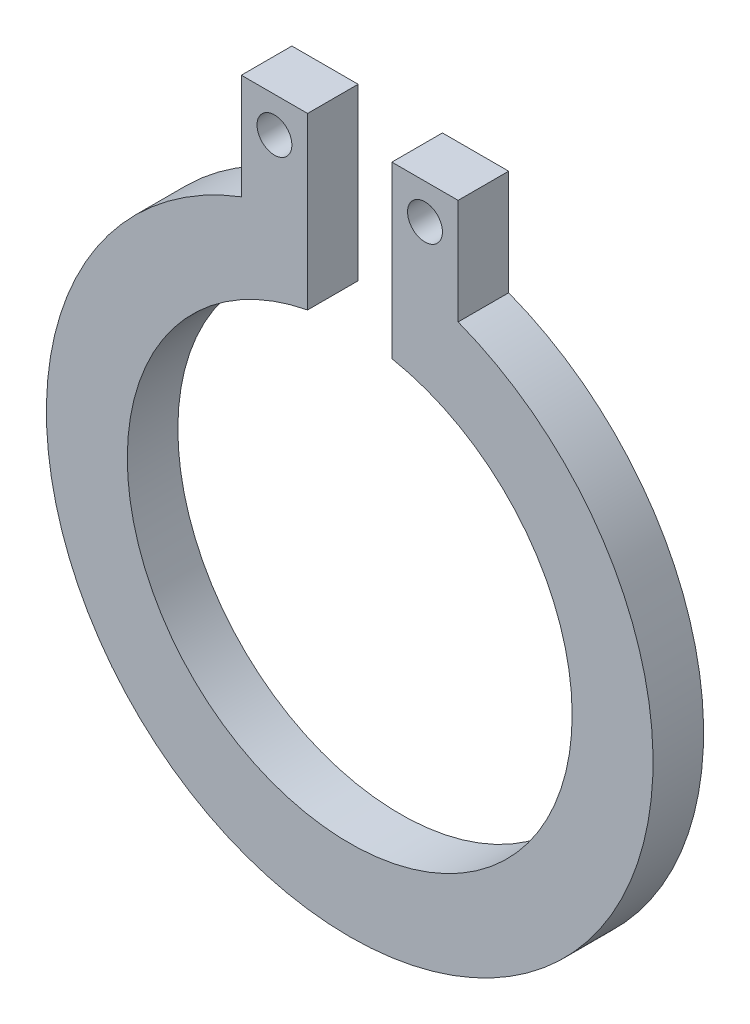
ISO-10303-21;
HEADER;
FILE_DESCRIPTION(('STEP AP214'),'2;1');
FILE_NAME('part.step','',(''),(''),'','','');
FILE_SCHEMA(('AUTOMOTIVE_DESIGN { 1 0 10303 214 1 1 1 1 }'));
ENDSEC;
DATA;
#1=APPLICATION_CONTEXT('core data for automotive mechanical design processes');
#2=APPLICATION_PROTOCOL_DEFINITION('international standard','automotive_design',2000,#1);
#3=PRODUCT_CONTEXT('',#1,'mechanical');
#4=PRODUCT('Part','Part','',(#3));
#5=PRODUCT_RELATED_PRODUCT_CATEGORY('part','',(#4));
#6=PRODUCT_DEFINITION_FORMATION('','',#4);
#7=PRODUCT_DEFINITION_CONTEXT('part definition',#1,'design');
#8=PRODUCT_DEFINITION('design','',#6,#7);
#9=PRODUCT_DEFINITION_SHAPE('','',#8);
#10=(LENGTH_UNIT() NAMED_UNIT(*) SI_UNIT(.MILLI.,.METRE.));
#11=(NAMED_UNIT(*) PLANE_ANGLE_UNIT() SI_UNIT($,.RADIAN.));
#12=(NAMED_UNIT(*) SI_UNIT($,.STERADIAN.) SOLID_ANGLE_UNIT());
#13=UNCERTAINTY_MEASURE_WITH_UNIT(LENGTH_MEASURE(1.E-05),#10,'distance_accuracy_value','');
#14=(GEOMETRIC_REPRESENTATION_CONTEXT(3) GLOBAL_UNCERTAINTY_ASSIGNED_CONTEXT((#13)) GLOBAL_UNIT_ASSIGNED_CONTEXT((#10,
#11,#12)) REPRESENTATION_CONTEXT('',''));
#15=CARTESIAN_POINT('',(0.,0.,0.));
#16=DIRECTION('',(0.,0.,1.));
#17=DIRECTION('',(1.,0.,0.));
#18=AXIS2_PLACEMENT_3D('',#15,#16,#17);
#19=CARTESIAN_POINT('',(0.,0.,0.5));
#20=DIRECTION('',(0.,0.,1.));
#21=DIRECTION('',(1.,0.,0.));
#22=AXIS2_PLACEMENT_3D('',#19,#20,#21);
#23=PLANE('',#22);
#24=CARTESIAN_POINT('',(0.744424879695825,3.49516054122899,0.5));
#25=DIRECTION('',(0.,0.,1.));
#26=DIRECTION('',(1.,0.,0.));
#27=AXIS2_PLACEMENT_3D('',#24,#25,#26);
#28=CIRCLE('',#27,0.172416740633927);
#29=CARTESIAN_POINT('',(0.916841620329752,3.49516054122899,0.5));
#30=VERTEX_POINT('',#29);
#31=EDGE_CURVE('E134',#30,#30,#28,.T.);
#32=ORIENTED_EDGE('',*,*,#31,.F.);
#33=EDGE_LOOP('',(#32));
#34=FACE_BOUND('',#33,.T.);
#35=CARTESIAN_POINT('',(0.,0.,0.5));
#36=DIRECTION('',(0.,0.,1.));
#37=DIRECTION('',(1.,0.,0.));
#38=AXIS2_PLACEMENT_3D('',#35,#36,#37);
#39=CIRCLE('',#38,3.);
#40=CARTESIAN_POINT('',(-1.07201668690029,2.80192437853118,0.5));
#41=VERTEX_POINT('',#40);
#42=CARTESIAN_POINT('',(1.07201668690029,2.80192437853118,0.5));
#43=VERTEX_POINT('',#42);
#44=EDGE_CURVE('E145',#41,#43,#39,.T.);
#45=ORIENTED_EDGE('',*,*,#44,.T.);
#46=DIRECTION('',(0.,1.,0.));
#47=VECTOR('',#46,1.);
#48=CARTESIAN_POINT('',(1.07201668690029,2.80192437853118,0.5));
#49=LINE('',#48,#47);
#50=CARTESIAN_POINT('',(1.07201668690029,3.84367980887387,0.5));
#51=VERTEX_POINT('',#50);
#52=EDGE_CURVE('E93',#43,#51,#49,.T.);
#53=ORIENTED_EDGE('',*,*,#52,.T.);
#54=DIRECTION('',(-1.,0.,0.));
#55=VECTOR('',#54,1.);
#56=CARTESIAN_POINT('',(1.07201668690029,3.84367980887387,0.5));
#57=LINE('',#56,#55);
#58=CARTESIAN_POINT('',(0.416833072491364,3.84367980887387,0.5));
#59=VERTEX_POINT('',#58);
#60=EDGE_CURVE('E160',#51,#59,#57,.T.);
#61=ORIENTED_EDGE('',*,*,#60,.T.);
#62=DIRECTION('',(0.,-1.,0.));
#63=VECTOR('',#62,1.);
#64=CARTESIAN_POINT('',(0.416833072491364,3.84367980887387,0.5));
#65=LINE('',#64,#63);
#66=CARTESIAN_POINT('',(0.416833072491364,2.16015050162654,0.5));
#67=VERTEX_POINT('',#66);
#68=EDGE_CURVE('E173',#59,#67,#65,.T.);
#69=ORIENTED_EDGE('',*,*,#68,.T.);
#70=CARTESIAN_POINT('',(0.,0.,0.5));
#71=DIRECTION('',(0.,0.,-1.));
#72=DIRECTION('',(1.,0.,0.));
#73=AXIS2_PLACEMENT_3D('',#70,#71,#72);
#74=CIRCLE('',#73,2.2);
#75=CARTESIAN_POINT('',(-0.416833072491364,2.16015050162654,0.5));
#76=VERTEX_POINT('',#75);
#77=EDGE_CURVE('E112',#67,#76,#74,.T.);
#78=ORIENTED_EDGE('',*,*,#77,.T.);
#79=DIRECTION('',(0.,1.,0.));
#80=VECTOR('',#79,1.);
#81=CARTESIAN_POINT('',(-0.416833072491364,3.84367980887387,0.5));
#82=LINE('',#81,#80);
#83=CARTESIAN_POINT('',(-0.416833072491364,3.84367980887387,0.5));
#84=VERTEX_POINT('',#83);
#85=EDGE_CURVE('E106',#76,#84,#82,.T.);
#86=ORIENTED_EDGE('',*,*,#85,.T.);
#87=DIRECTION('',(-1.,0.,0.));
#88=VECTOR('',#87,1.);
#89=CARTESIAN_POINT('',(-1.07201668690029,3.84367980887387,0.5));
#90=LINE('',#89,#88);
#91=CARTESIAN_POINT('',(-1.07201668690029,3.84367980887387,0.5));
#92=VERTEX_POINT('',#91);
#93=EDGE_CURVE('E110',#84,#92,#90,.T.);
#94=ORIENTED_EDGE('',*,*,#93,.T.);
#95=DIRECTION('',(0.,-1.,0.));
#96=VECTOR('',#95,1.);
#97=CARTESIAN_POINT('',(-1.07201668690029,2.80192437853118,0.5));
#98=LINE('',#97,#96);
#99=EDGE_CURVE('E50',#92,#41,#98,.T.);
#100=ORIENTED_EDGE('',*,*,#99,.T.);
#101=EDGE_LOOP('',(#45,#53,#61,#69,#78,#86,#94,#100));
#102=FACE_BOUND('',#101,.T.);
#103=CARTESIAN_POINT('',(-0.744424879695825,3.49516054122899,0.5));
#104=DIRECTION('',(0.,0.,1.));
#105=DIRECTION('',(-1.,0.,0.));
#106=AXIS2_PLACEMENT_3D('',#103,#104,#105);
#107=CIRCLE('',#106,0.172416740633927);
#108=CARTESIAN_POINT('',(-0.916841620329752,3.49516054122899,0.5));
#109=VERTEX_POINT('',#108);
#110=EDGE_CURVE('E182',#109,#109,#107,.T.);
#111=ORIENTED_EDGE('',*,*,#110,.F.);
#112=EDGE_LOOP('',(#111));
#113=FACE_BOUND('',#112,.T.);
#114=ADVANCED_FACE('F33',(#34,#102,#113),#23,.T.);
#115=CARTESIAN_POINT('',(0.,0.,0.));
#116=DIRECTION('',(0.,0.,1.));
#117=DIRECTION('',(1.,0.,0.));
#118=AXIS2_PLACEMENT_3D('',#115,#116,#117);
#119=PLANE('',#118);
#120=CARTESIAN_POINT('',(0.,0.,0.));
#121=DIRECTION('',(0.,0.,1.));
#122=DIRECTION('',(1.,0.,0.));
#123=AXIS2_PLACEMENT_3D('',#120,#121,#122);
#124=CIRCLE('',#123,3.);
#125=CARTESIAN_POINT('',(-1.07201668690029,2.80192437853118,0.));
#126=VERTEX_POINT('',#125);
#127=CARTESIAN_POINT('',(1.07201668690029,2.80192437853118,0.));
#128=VERTEX_POINT('',#127);
#129=EDGE_CURVE('E130',#126,#128,#124,.T.);
#130=ORIENTED_EDGE('',*,*,#129,.F.);
#131=DIRECTION('',(0.,-1.,0.));
#132=VECTOR('',#131,1.);
#133=CARTESIAN_POINT('',(-1.07201668690029,2.80192437853118,0.));
#134=LINE('',#133,#132);
#135=CARTESIAN_POINT('',(-1.07201668690029,3.84367980887387,0.));
#136=VERTEX_POINT('',#135);
#137=EDGE_CURVE('E85',#136,#126,#134,.T.);
#138=ORIENTED_EDGE('',*,*,#137,.F.);
#139=DIRECTION('',(-1.,0.,0.));
#140=VECTOR('',#139,1.);
#141=CARTESIAN_POINT('',(-1.07201668690029,3.84367980887387,0.));
#142=LINE('',#141,#140);
#143=CARTESIAN_POINT('',(-0.416833072491364,3.84367980887387,0.));
#144=VERTEX_POINT('',#143);
#145=EDGE_CURVE('E79',#144,#136,#142,.T.);
#146=ORIENTED_EDGE('',*,*,#145,.F.);
#147=DIRECTION('',(0.,1.,0.));
#148=VECTOR('',#147,1.);
#149=CARTESIAN_POINT('',(-0.416833072491364,3.84367980887387,0.));
#150=LINE('',#149,#148);
#151=CARTESIAN_POINT('',(-0.416833072491364,2.16015050162654,0.));
#152=VERTEX_POINT('',#151);
#153=EDGE_CURVE('E120',#152,#144,#150,.T.);
#154=ORIENTED_EDGE('',*,*,#153,.F.);
#155=CARTESIAN_POINT('',(0.,0.,0.));
#156=DIRECTION('',(0.,0.,-1.));
#157=DIRECTION('',(1.,0.,0.));
#158=AXIS2_PLACEMENT_3D('',#155,#156,#157);
#159=CIRCLE('',#158,2.2);
#160=CARTESIAN_POINT('',(0.416833072491364,2.16015050162654,0.));
#161=VERTEX_POINT('',#160);
#162=EDGE_CURVE('E140',#161,#152,#159,.T.);
#163=ORIENTED_EDGE('',*,*,#162,.F.);
#164=DIRECTION('',(0.,-1.,0.));
#165=VECTOR('',#164,1.);
#166=CARTESIAN_POINT('',(0.416833072491364,3.84367980887387,0.));
#167=LINE('',#166,#165);
#168=CARTESIAN_POINT('',(0.416833072491364,3.84367980887387,0.));
#169=VERTEX_POINT('',#168);
#170=EDGE_CURVE('E138',#169,#161,#167,.T.);
#171=ORIENTED_EDGE('',*,*,#170,.F.);
#172=DIRECTION('',(-1.,0.,0.));
#173=VECTOR('',#172,1.);
#174=CARTESIAN_POINT('',(1.07201668690029,3.84367980887387,0.));
#175=LINE('',#174,#173);
#176=CARTESIAN_POINT('',(1.07201668690029,3.84367980887387,0.));
#177=VERTEX_POINT('',#176);
#178=EDGE_CURVE('E136',#177,#169,#175,.T.);
#179=ORIENTED_EDGE('',*,*,#178,.F.);
#180=DIRECTION('',(0.,1.,0.));
#181=VECTOR('',#180,1.);
#182=CARTESIAN_POINT('',(1.07201668690029,2.80192437853118,0.));
#183=LINE('',#182,#181);
#184=EDGE_CURVE('E133',#128,#177,#183,.T.);
#185=ORIENTED_EDGE('',*,*,#184,.F.);
#186=EDGE_LOOP('',(#130,#138,#146,#154,#163,#171,#179,#185));
#187=FACE_BOUND('',#186,.T.);
#188=CARTESIAN_POINT('',(0.744424879695825,3.49516054122899,0.));
#189=DIRECTION('',(0.,0.,1.));
#190=DIRECTION('',(1.,0.,0.));
#191=AXIS2_PLACEMENT_3D('',#188,#189,#190);
#192=CIRCLE('',#191,0.172416740633927);
#193=CARTESIAN_POINT('',(0.916841620329752,3.49516054122899,0.));
#194=VERTEX_POINT('',#193);
#195=EDGE_CURVE('E179',#194,#194,#192,.T.);
#196=ORIENTED_EDGE('',*,*,#195,.T.);
#197=EDGE_LOOP('',(#196));
#198=FACE_BOUND('',#197,.T.);
#199=CARTESIAN_POINT('',(-0.744424879695825,3.49516054122899,0.));
#200=DIRECTION('',(0.,0.,1.));
#201=DIRECTION('',(-1.,0.,0.));
#202=AXIS2_PLACEMENT_3D('',#199,#200,#201);
#203=CIRCLE('',#202,0.172416740633927);
#204=CARTESIAN_POINT('',(-0.916841620329752,3.49516054122899,0.));
#205=VERTEX_POINT('',#204);
#206=EDGE_CURVE('E185',#205,#205,#203,.T.);
#207=ORIENTED_EDGE('',*,*,#206,.T.);
#208=EDGE_LOOP('',(#207));
#209=FACE_BOUND('',#208,.T.);
#210=ADVANCED_FACE('F164',(#187,#198,#209),#119,.F.);
#211=CARTESIAN_POINT('',(0.,0.,0.5));
#212=DIRECTION('',(0.,0.,-1.));
#213=DIRECTION('',(-1.,0.,0.));
#214=AXIS2_PLACEMENT_3D('',#211,#212,#213);
#215=CYLINDRICAL_SURFACE('',#214,3.);
#216=ORIENTED_EDGE('',*,*,#129,.T.);
#217=DIRECTION('',(0.,0.,-1.));
#218=VECTOR('',#217,1.);
#219=CARTESIAN_POINT('',(1.07201668690029,2.80192437853118,0.5));
#220=LINE('',#219,#218);
#221=EDGE_CURVE('E11',#43,#128,#220,.T.);
#222=ORIENTED_EDGE('',*,*,#221,.F.);
#223=ORIENTED_EDGE('',*,*,#44,.F.);
#224=DIRECTION('',(0.,0.,-1.));
#225=VECTOR('',#224,1.);
#226=CARTESIAN_POINT('',(-1.07201668690029,2.80192437853118,0.5));
#227=LINE('',#226,#225);
#228=EDGE_CURVE('E126',#41,#126,#227,.T.);
#229=ORIENTED_EDGE('',*,*,#228,.T.);
#230=EDGE_LOOP('',(#216,#222,#223,#229));
#231=FACE_BOUND('',#230,.T.);
#232=ADVANCED_FACE('F35',(#231),#215,.T.);
#233=CARTESIAN_POINT('',(1.07201668690029,2.80192437853118,0.5));
#234=DIRECTION('',(-1.,0.,0.));
#235=DIRECTION('',(0.,0.,1.));
#236=AXIS2_PLACEMENT_3D('',#233,#234,#235);
#237=PLANE('',#236);
#238=ORIENTED_EDGE('',*,*,#184,.T.);
#239=DIRECTION('',(0.,0.,-1.));
#240=VECTOR('',#239,1.);
#241=CARTESIAN_POINT('',(1.07201668690029,3.84367980887387,0.5));
#242=LINE('',#241,#240);
#243=EDGE_CURVE('E42',#51,#177,#242,.T.);
#244=ORIENTED_EDGE('',*,*,#243,.F.);
#245=ORIENTED_EDGE('',*,*,#52,.F.);
#246=ORIENTED_EDGE('',*,*,#221,.T.);
#247=EDGE_LOOP('',(#238,#244,#245,#246));
#248=FACE_BOUND('',#247,.T.);
#249=ADVANCED_FACE('F217',(#248),#237,.F.);
#250=CARTESIAN_POINT('',(1.07201668690029,3.84367980887387,0.5));
#251=DIRECTION('',(0.,-1.,0.));
#252=DIRECTION('',(0.,0.,-1.));
#253=AXIS2_PLACEMENT_3D('',#250,#251,#252);
#254=PLANE('',#253);
#255=ORIENTED_EDGE('',*,*,#178,.T.);
#256=DIRECTION('',(0.,0.,-1.));
#257=VECTOR('',#256,1.);
#258=CARTESIAN_POINT('',(0.416833072491364,3.84367980887387,0.5));
#259=LINE('',#258,#257);
#260=EDGE_CURVE('E152',#59,#169,#259,.T.);
#261=ORIENTED_EDGE('',*,*,#260,.F.);
#262=ORIENTED_EDGE('',*,*,#60,.F.);
#263=ORIENTED_EDGE('',*,*,#243,.T.);
#264=EDGE_LOOP('',(#255,#261,#262,#263));
#265=FACE_BOUND('',#264,.T.);
#266=ADVANCED_FACE('F158',(#265),#254,.F.);
#267=CARTESIAN_POINT('',(0.416833072491364,3.84367980887387,0.5));
#268=DIRECTION('',(1.,0.,0.));
#269=DIRECTION('',(0.,0.,-1.));
#270=AXIS2_PLACEMENT_3D('',#267,#268,#269);
#271=PLANE('',#270);
#272=ORIENTED_EDGE('',*,*,#170,.T.);
#273=DIRECTION('',(0.,0.,-1.));
#274=VECTOR('',#273,1.);
#275=CARTESIAN_POINT('',(0.416833072491364,2.16015050162654,0.5));
#276=LINE('',#275,#274);
#277=EDGE_CURVE('E149',#67,#161,#276,.T.);
#278=ORIENTED_EDGE('',*,*,#277,.F.);
#279=ORIENTED_EDGE('',*,*,#68,.F.);
#280=ORIENTED_EDGE('',*,*,#260,.T.);
#281=EDGE_LOOP('',(#272,#278,#279,#280));
#282=FACE_BOUND('',#281,.T.);
#283=ADVANCED_FACE('F169',(#282),#271,.F.);
#284=CARTESIAN_POINT('',(0.,0.,0.5));
#285=DIRECTION('',(0.,0.,-1.));
#286=DIRECTION('',(-1.,0.,0.));
#287=AXIS2_PLACEMENT_3D('',#284,#285,#286);
#288=CYLINDRICAL_SURFACE('',#287,2.2);
#289=ORIENTED_EDGE('',*,*,#162,.T.);
#290=DIRECTION('',(0.,0.,-1.));
#291=VECTOR('',#290,1.);
#292=CARTESIAN_POINT('',(-0.416833072491364,2.16015050162654,0.5));
#293=LINE('',#292,#291);
#294=EDGE_CURVE('E121',#76,#152,#293,.T.);
#295=ORIENTED_EDGE('',*,*,#294,.F.);
#296=ORIENTED_EDGE('',*,*,#77,.F.);
#297=ORIENTED_EDGE('',*,*,#277,.T.);
#298=EDGE_LOOP('',(#289,#295,#296,#297));
#299=FACE_BOUND('',#298,.T.);
#300=ADVANCED_FACE('F172',(#299),#288,.F.);
#301=CARTESIAN_POINT('',(-0.416833072491364,3.84367980887387,0.5));
#302=DIRECTION('',(-1.,0.,0.));
#303=DIRECTION('',(0.,0.,1.));
#304=AXIS2_PLACEMENT_3D('',#301,#302,#303);
#305=PLANE('',#304);
#306=ORIENTED_EDGE('',*,*,#153,.T.);
#307=DIRECTION('',(0.,0.,-1.));
#308=VECTOR('',#307,1.);
#309=CARTESIAN_POINT('',(-0.416833072491364,3.84367980887387,0.5));
#310=LINE('',#309,#308);
#311=EDGE_CURVE('E117',#84,#144,#310,.T.);
#312=ORIENTED_EDGE('',*,*,#311,.F.);
#313=ORIENTED_EDGE('',*,*,#85,.F.);
#314=ORIENTED_EDGE('',*,*,#294,.T.);
#315=EDGE_LOOP('',(#306,#312,#313,#314));
#316=FACE_BOUND('',#315,.T.);
#317=ADVANCED_FACE('F118',(#316),#305,.F.);
#318=CARTESIAN_POINT('',(-1.07201668690029,3.84367980887387,0.5));
#319=DIRECTION('',(0.,-1.,0.));
#320=DIRECTION('',(0.,0.,-1.));
#321=AXIS2_PLACEMENT_3D('',#318,#319,#320);
#322=PLANE('',#321);
#323=ORIENTED_EDGE('',*,*,#145,.T.);
#324=DIRECTION('',(0.,0.,-1.));
#325=VECTOR('',#324,1.);
#326=CARTESIAN_POINT('',(-1.07201668690029,3.84367980887387,0.5));
#327=LINE('',#326,#325);
#328=EDGE_CURVE('E122',#92,#136,#327,.T.);
#329=ORIENTED_EDGE('',*,*,#328,.F.);
#330=ORIENTED_EDGE('',*,*,#93,.F.);
#331=ORIENTED_EDGE('',*,*,#311,.T.);
#332=EDGE_LOOP('',(#323,#329,#330,#331));
#333=FACE_BOUND('',#332,.T.);
#334=ADVANCED_FACE('F124',(#333),#322,.F.);
#335=CARTESIAN_POINT('',(-1.07201668690029,2.80192437853118,0.5));
#336=DIRECTION('',(1.,0.,0.));
#337=DIRECTION('',(0.,0.,-1.));
#338=AXIS2_PLACEMENT_3D('',#335,#336,#337);
#339=PLANE('',#338);
#340=ORIENTED_EDGE('',*,*,#137,.T.);
#341=ORIENTED_EDGE('',*,*,#228,.F.);
#342=ORIENTED_EDGE('',*,*,#99,.F.);
#343=ORIENTED_EDGE('',*,*,#328,.T.);
#344=EDGE_LOOP('',(#340,#341,#342,#343));
#345=FACE_BOUND('',#344,.T.);
#346=ADVANCED_FACE('F205',(#345),#339,.F.);
#347=CARTESIAN_POINT('',(0.744424879695825,3.49516054122899,0.5));
#348=DIRECTION('',(0.,0.,-1.));
#349=DIRECTION('',(-1.,0.,0.));
#350=AXIS2_PLACEMENT_3D('',#347,#348,#349);
#351=CYLINDRICAL_SURFACE('',#350,0.172416740633927);
#352=ORIENTED_EDGE('',*,*,#31,.T.);
#353=EDGE_LOOP('',(#352));
#354=FACE_BOUND('',#353,.T.);
#355=ORIENTED_EDGE('',*,*,#195,.F.);
#356=EDGE_LOOP('',(#355));
#357=FACE_BOUND('',#356,.T.);
#358=ADVANCED_FACE('F202',(#354,#357),#351,.F.);
#359=CARTESIAN_POINT('',(-0.744424879695825,3.49516054122899,0.5));
#360=DIRECTION('',(0.,0.,-1.));
#361=DIRECTION('',(-1.,0.,0.));
#362=AXIS2_PLACEMENT_3D('',#359,#360,#361);
#363=CYLINDRICAL_SURFACE('',#362,0.172416740633927);
#364=ORIENTED_EDGE('',*,*,#110,.T.);
#365=EDGE_LOOP('',(#364));
#366=FACE_BOUND('',#365,.T.);
#367=ORIENTED_EDGE('',*,*,#206,.F.);
#368=EDGE_LOOP('',(#367));
#369=FACE_BOUND('',#368,.T.);
#370=ADVANCED_FACE('F191',(#366,#369),#363,.F.);
#371=CLOSED_SHELL('',(#114,#210,#232,#249,#266,#283,#300,#317,#334,#346,#358,#370));
#372=MANIFOLD_SOLID_BREP('B2',#371);
#373=ADVANCED_BREP_SHAPE_REPRESENTATION('',(#18,#372),#14);
#374=SHAPE_DEFINITION_REPRESENTATION(#9,#373);
ENDSEC;
END-ISO-10303-21;
